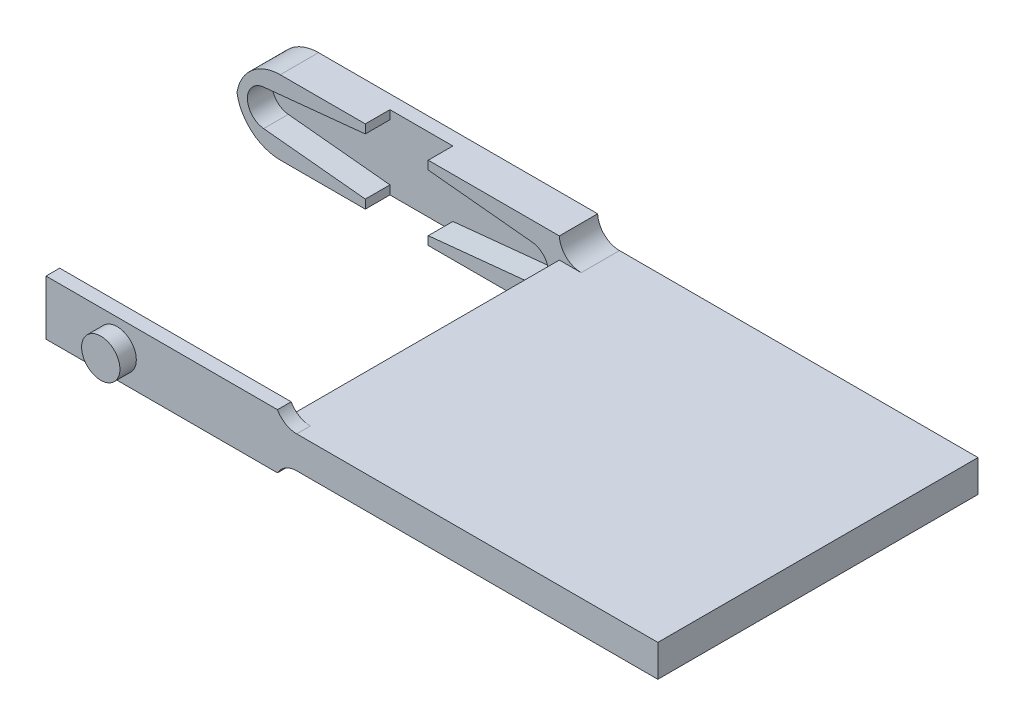
ISO-10303-21;
HEADER;
FILE_DESCRIPTION(('STEP AP214'),'2;1');
FILE_NAME('part.step','',(''),(''),'','','');
FILE_SCHEMA(('AUTOMOTIVE_DESIGN { 1 0 10303 214 1 1 1 1 }'));
ENDSEC;
DATA;
#1=APPLICATION_CONTEXT('core data for automotive mechanical design processes');
#2=APPLICATION_PROTOCOL_DEFINITION('international standard','automotive_design',2000,#1);
#3=PRODUCT_CONTEXT('',#1,'mechanical');
#4=PRODUCT('Part','Part','',(#3));
#5=PRODUCT_RELATED_PRODUCT_CATEGORY('part','',(#4));
#6=PRODUCT_DEFINITION_FORMATION('','',#4);
#7=PRODUCT_DEFINITION_CONTEXT('part definition',#1,'design');
#8=PRODUCT_DEFINITION('design','',#6,#7);
#9=PRODUCT_DEFINITION_SHAPE('','',#8);
#10=(LENGTH_UNIT() NAMED_UNIT(*) SI_UNIT(.MILLI.,.METRE.));
#11=(NAMED_UNIT(*) PLANE_ANGLE_UNIT() SI_UNIT($,.RADIAN.));
#12=(NAMED_UNIT(*) SI_UNIT($,.STERADIAN.) SOLID_ANGLE_UNIT());
#13=UNCERTAINTY_MEASURE_WITH_UNIT(LENGTH_MEASURE(1.E-05),#10,'distance_accuracy_value','');
#14=(GEOMETRIC_REPRESENTATION_CONTEXT(3) GLOBAL_UNCERTAINTY_ASSIGNED_CONTEXT((#13)) GLOBAL_UNIT_ASSIGNED_CONTEXT((#10,
#11,#12)) REPRESENTATION_CONTEXT('',''));
#15=CARTESIAN_POINT('',(0.,0.,0.));
#16=DIRECTION('',(0.,0.,1.));
#17=DIRECTION('',(1.,0.,0.));
#18=AXIS2_PLACEMENT_3D('',#15,#16,#17);
#19=CARTESIAN_POINT('',(0.,0.,29.25));
#20=DIRECTION('',(0.,0.,1.));
#21=DIRECTION('',(1.,0.,0.));
#22=AXIS2_PLACEMENT_3D('',#19,#20,#21);
#23=PLANE('',#22);
#24=DIRECTION('',(1.,0.,0.));
#25=VECTOR('',#24,1.);
#26=CARTESIAN_POINT('',(0.,4.83707186120483,29.25));
#27=LINE('',#26,#25);
#28=CARTESIAN_POINT('',(16.5034017605437,4.83707186120483,29.25));
#29=VERTEX_POINT('',#28);
#30=CARTESIAN_POINT('',(49.5,4.83707186120483,29.25));
#31=VERTEX_POINT('',#30);
#32=EDGE_CURVE('E509',#29,#31,#27,.T.);
#33=ORIENTED_EDGE('',*,*,#32,.F.);
#34=CARTESIAN_POINT('',(16.5034017605437,6.83707186120483,29.25));
#35=DIRECTION('',(0.,0.,1.));
#36=DIRECTION('',(1.,0.,0.));
#37=AXIS2_PLACEMENT_3D('',#34,#35,#36);
#38=CIRCLE('',#37,2.);
#39=CARTESIAN_POINT('',(14.75,5.87500000000001,29.25));
#40=VERTEX_POINT('',#39);
#41=EDGE_CURVE('E445',#29,#40,#38,.F.);
#42=ORIENTED_EDGE('',*,*,#41,.T.);
#43=DIRECTION('',(1.,0.,0.));
#44=VECTOR('',#43,1.);
#45=CARTESIAN_POINT('',(0.,5.87500000000001,29.25));
#46=LINE('',#45,#44);
#47=CARTESIAN_POINT('',(-6.4,5.875,29.25));
#48=VERTEX_POINT('',#47);
#49=EDGE_CURVE('E470',#48,#40,#46,.T.);
#50=ORIENTED_EDGE('',*,*,#49,.F.);
#51=DIRECTION('',(0.,-1.,0.));
#52=VECTOR('',#51,1.);
#53=CARTESIAN_POINT('',(-6.4,0.,29.25));
#54=LINE('',#53,#52);
#55=CARTESIAN_POINT('',(-6.4,0.875000000000003,29.25));
#56=VERTEX_POINT('',#55);
#57=EDGE_CURVE('E473',#48,#56,#54,.T.);
#58=ORIENTED_EDGE('',*,*,#57,.T.);
#59=DIRECTION('',(1.,0.,0.));
#60=VECTOR('',#59,1.);
#61=CARTESIAN_POINT('',(0.,0.875000000000003,29.25));
#62=LINE('',#61,#60);
#63=CARTESIAN_POINT('',(14.75,0.875000000000003,29.25));
#64=VERTEX_POINT('',#63);
#65=EDGE_CURVE('E488',#56,#64,#62,.T.);
#66=ORIENTED_EDGE('',*,*,#65,.T.);
#67=CARTESIAN_POINT('',(16.5034017605437,-0.0870718612048299,29.25));
#68=DIRECTION('',(0.,0.,1.));
#69=DIRECTION('',(1.,0.,0.));
#70=AXIS2_PLACEMENT_3D('',#67,#68,#69);
#71=CIRCLE('',#70,2.);
#72=CARTESIAN_POINT('',(16.5034017605437,1.91292813879517,29.25));
#73=VERTEX_POINT('',#72);
#74=EDGE_CURVE('E449',#64,#73,#71,.F.);
#75=ORIENTED_EDGE('',*,*,#74,.T.);
#76=DIRECTION('',(1.,0.,0.));
#77=VECTOR('',#76,1.);
#78=CARTESIAN_POINT('',(0.,1.91292813879517,29.25));
#79=LINE('',#78,#77);
#80=CARTESIAN_POINT('',(49.5,1.91292813879517,29.25));
#81=VERTEX_POINT('',#80);
#82=EDGE_CURVE('E511',#73,#81,#79,.T.);
#83=ORIENTED_EDGE('',*,*,#82,.T.);
#84=DIRECTION('',(0.,-1.,0.));
#85=VECTOR('',#84,1.);
#86=CARTESIAN_POINT('',(49.5,0.,29.25));
#87=LINE('',#86,#85);
#88=EDGE_CURVE('E513',#31,#81,#87,.T.);
#89=ORIENTED_EDGE('',*,*,#88,.F.);
#90=EDGE_LOOP('',(#33,#42,#50,#58,#66,#75,#83,#89));
#91=FACE_BOUND('',#90,.T.);
#92=CARTESIAN_POINT('',(0.102107464172212,3.37499999999922,29.25));
#93=DIRECTION('',(0.,0.,1.));
#94=DIRECTION('',(1.,0.,0.));
#95=AXIS2_PLACEMENT_3D('',#92,#93,#94);
#96=CIRCLE('',#95,1.75000000000137);
#97=CARTESIAN_POINT('',(1.85210746417358,3.37499999999922,29.25));
#98=VERTEX_POINT('',#97);
#99=EDGE_CURVE('E592',#98,#98,#96,.T.);
#100=ORIENTED_EDGE('',*,*,#99,.F.);
#101=EDGE_LOOP('',(#100));
#102=FACE_BOUND('',#101,.T.);
#103=ADVANCED_FACE('F139',(#91,#102),#23,.T.);
#104=CARTESIAN_POINT('',(0.,0.,3.5));
#105=DIRECTION('',(0.,0.,1.));
#106=DIRECTION('',(1.,0.,0.));
#107=AXIS2_PLACEMENT_3D('',#104,#105,#106);
#108=PLANE('',#107);
#109=DIRECTION('',(0.,-1.,0.));
#110=VECTOR('',#109,1.);
#111=CARTESIAN_POINT('',(-2.97710746417336,0.,3.5));
#112=LINE('',#111,#110);
#113=CARTESIAN_POINT('',(-2.97710746417336,0.799354218210052,3.5));
#114=VERTEX_POINT('',#113);
#115=CARTESIAN_POINT('',(-2.97710746417336,0.,3.5));
#116=VERTEX_POINT('',#115);
#117=EDGE_CURVE('E330',#114,#116,#112,.T.);
#118=ORIENTED_EDGE('',*,*,#117,.F.);
#119=DIRECTION('',(0.994982658758142,-0.10004753255617,0.));
#120=VECTOR('',#119,1.);
#121=CARTESIAN_POINT('',(0.0497727799724651,0.494995245614711,3.5));
#122=LINE('',#121,#120);
#123=CARTESIAN_POINT('',(-12.2650784287177,1.73327861304907,3.5));
#124=VERTEX_POINT('',#123);
#125=EDGE_CURVE('E370',#124,#114,#122,.T.);
#126=ORIENTED_EDGE('',*,*,#125,.F.);
#127=CARTESIAN_POINT('',(-12.1,3.375,3.5));
#128=DIRECTION('',(0.,0.,1.));
#129=DIRECTION('',(1.,0.,0.));
#130=AXIS2_PLACEMENT_3D('',#127,#128,#129);
#131=CIRCLE('',#130,1.65);
#132=CARTESIAN_POINT('',(-12.2650784287177,5.01672138695093,3.5));
#133=VERTEX_POINT('',#132);
#134=EDGE_CURVE('E372',#133,#124,#131,.T.);
#135=ORIENTED_EDGE('',*,*,#134,.F.);
#136=DIRECTION('',(0.994982658758143,0.100047532556171,0.));
#137=VECTOR('',#136,1.);
#138=CARTESIAN_POINT('',(-0.622159749655816,6.18744057018389,3.5));
#139=LINE('',#138,#137);
#140=CARTESIAN_POINT('',(-2.97710746417334,5.95064578178995,3.5));
#141=VERTEX_POINT('',#140);
#142=EDGE_CURVE('E375',#133,#141,#139,.T.);
#143=ORIENTED_EDGE('',*,*,#142,.T.);
#144=DIRECTION('',(0.,-1.,0.));
#145=VECTOR('',#144,1.);
#146=CARTESIAN_POINT('',(-2.97710746417327,6.74999999999991,3.5));
#147=LINE('',#146,#145);
#148=CARTESIAN_POINT('',(-2.97710746417327,6.74999999999991,3.5));
#149=VERTEX_POINT('',#148);
#150=EDGE_CURVE('E605',#149,#141,#147,.T.);
#151=ORIENTED_EDGE('',*,*,#150,.F.);
#152=DIRECTION('',(1.,0.,0.));
#153=VECTOR('',#152,1.);
#154=CARTESIAN_POINT('',(0.,6.75,3.5));
#155=LINE('',#154,#153);
#156=CARTESIAN_POINT('',(-10.75,6.75,3.5));
#157=VERTEX_POINT('',#156);
#158=EDGE_CURVE('E361',#157,#149,#155,.T.);
#159=ORIENTED_EDGE('',*,*,#158,.F.);
#160=CARTESIAN_POINT('',(-10.75,2.75,3.5));
#161=DIRECTION('',(0.,0.,1.));
#162=DIRECTION('',(1.,0.,0.));
#163=AXIS2_PLACEMENT_3D('',#160,#161,#162);
#164=CIRCLE('',#163,4.);
#165=CARTESIAN_POINT('',(-14.7008701573198,3.37499999999999,3.5));
#166=VERTEX_POINT('',#165);
#167=EDGE_CURVE('E148',#157,#166,#164,.T.);
#168=ORIENTED_EDGE('',*,*,#167,.T.);
#169=CARTESIAN_POINT('',(-10.75,4.,3.5));
#170=DIRECTION('',(0.,0.,1.));
#171=DIRECTION('',(1.,0.,0.));
#172=AXIS2_PLACEMENT_3D('',#169,#170,#171);
#173=CIRCLE('',#172,4.);
#174=CARTESIAN_POINT('',(-10.75,0.,3.5));
#175=VERTEX_POINT('',#174);
#176=EDGE_CURVE('E354',#166,#175,#173,.T.);
#177=ORIENTED_EDGE('',*,*,#176,.T.);
#178=DIRECTION('',(1.,0.,0.));
#179=VECTOR('',#178,1.);
#180=CARTESIAN_POINT('',(0.,0.,3.5));
#181=LINE('',#180,#179);
#182=EDGE_CURVE('E347',#175,#116,#181,.T.);
#183=ORIENTED_EDGE('',*,*,#182,.T.);
#184=EDGE_LOOP('',(#118,#126,#135,#143,#151,#159,#168,#177,#183));
#185=FACE_BOUND('',#184,.T.);
#186=ADVANCED_FACE('F352',(#185),#108,.T.);
#187=CARTESIAN_POINT('',(14.75,0.,29.25));
#188=DIRECTION('',(1.,0.,0.));
#189=DIRECTION('',(0.,1.,0.));
#190=AXIS2_PLACEMENT_3D('',#187,#188,#189);
#191=PLANE('',#190);
#192=DIRECTION('',(0.,-1.,0.));
#193=VECTOR('',#192,1.);
#194=CARTESIAN_POINT('',(14.75,0.,28.));
#195=LINE('',#194,#193);
#196=CARTESIAN_POINT('',(14.75,4.83707186120483,28.));
#197=VERTEX_POINT('',#196);
#198=CARTESIAN_POINT('',(14.75,1.91292813879517,28.));
#199=VERTEX_POINT('',#198);
#200=EDGE_CURVE('E484',#197,#199,#195,.T.);
#201=ORIENTED_EDGE('',*,*,#200,.F.);
#202=DIRECTION('',(0.,0.,-1.));
#203=VECTOR('',#202,1.);
#204=CARTESIAN_POINT('',(14.75,4.83707186120483,29.25));
#205=LINE('',#204,#203);
#206=CARTESIAN_POINT('',(14.75,4.83707186120483,3.5));
#207=VERTEX_POINT('',#206);
#208=EDGE_CURVE('E527',#197,#207,#205,.T.);
#209=ORIENTED_EDGE('',*,*,#208,.T.);
#210=DIRECTION('',(0.,-1.,0.));
#211=VECTOR('',#210,1.);
#212=CARTESIAN_POINT('',(14.75,0.,3.5));
#213=LINE('',#212,#211);
#214=CARTESIAN_POINT('',(14.75,1.91292813879517,3.5));
#215=VERTEX_POINT('',#214);
#216=EDGE_CURVE('E384',#207,#215,#213,.T.);
#217=ORIENTED_EDGE('',*,*,#216,.T.);
#218=DIRECTION('',(0.,0.,-1.));
#219=VECTOR('',#218,1.);
#220=CARTESIAN_POINT('',(14.75,1.91292813879517,29.25));
#221=LINE('',#220,#219);
#222=EDGE_CURVE('E524',#199,#215,#221,.T.);
#223=ORIENTED_EDGE('',*,*,#222,.F.);
#224=EDGE_LOOP('',(#201,#209,#217,#223));
#225=FACE_BOUND('',#224,.T.);
#226=ADVANCED_FACE('F647',(#225),#191,.F.);
#227=CARTESIAN_POINT('',(0.622159749655816,6.18744057018389,3.5));
#228=DIRECTION('',(-0.100047532556171,-0.994982658758142,0.));
#229=DIRECTION('',(0.994982658758142,-0.100047532556171,0.));
#230=AXIS2_PLACEMENT_3D('',#227,#228,#229);
#231=PLANE('',#230);
#232=DIRECTION('',(0.,0.,1.));
#233=VECTOR('',#232,1.);
#234=CARTESIAN_POINT('',(2.77289253582672,5.97118000870574,3.5));
#235=LINE('',#234,#233);
#236=CARTESIAN_POINT('',(2.77289253582672,5.97118000870574,1.24999999999997));
#237=VERTEX_POINT('',#236);
#238=CARTESIAN_POINT('',(2.77289253582672,5.97118000870574,3.5));
#239=VERTEX_POINT('',#238);
#240=EDGE_CURVE('E163',#237,#239,#235,.T.);
#241=ORIENTED_EDGE('',*,*,#240,.F.);
#242=DIRECTION('',(-0.994982658758143,0.100047532556171,0.));
#243=VECTOR('',#242,1.);
#244=CARTESIAN_POINT('',(0.622159749655816,6.18744057018389,1.25));
#245=LINE('',#244,#243);
#246=CARTESIAN_POINT('',(12.2650784287177,5.01672138695093,1.25));
#247=VERTEX_POINT('',#246);
#248=EDGE_CURVE('E533',#247,#237,#245,.T.);
#249=ORIENTED_EDGE('',*,*,#248,.F.);
#250=DIRECTION('',(0.,0.,-1.));
#251=VECTOR('',#250,1.);
#252=CARTESIAN_POINT('',(12.2650784287177,5.01672138695093,3.5));
#253=LINE('',#252,#251);
#254=CARTESIAN_POINT('',(12.2650784287177,5.01672138695093,3.5));
#255=VERTEX_POINT('',#254);
#256=EDGE_CURVE('E395',#255,#247,#253,.T.);
#257=ORIENTED_EDGE('',*,*,#256,.F.);
#258=DIRECTION('',(-0.994982658758143,0.100047532556171,0.));
#259=VECTOR('',#258,1.);
#260=CARTESIAN_POINT('',(0.622159749655816,6.18744057018389,3.5));
#261=LINE('',#260,#259);
#262=EDGE_CURVE('E355',#255,#239,#261,.T.);
#263=ORIENTED_EDGE('',*,*,#262,.T.);
#264=EDGE_LOOP('',(#241,#249,#257,#263));
#265=FACE_BOUND('',#264,.T.);
#266=ADVANCED_FACE('F662',(#265),#231,.T.);
#267=CARTESIAN_POINT('',(12.1,3.375,3.5));
#268=DIRECTION('',(0.,0.,-1.));
#269=DIRECTION('',(-1.,0.,0.));
#270=AXIS2_PLACEMENT_3D('',#267,#268,#269);
#271=CYLINDRICAL_SURFACE('',#270,1.64999999999999);
#272=ORIENTED_EDGE('',*,*,#256,.T.);
#273=CARTESIAN_POINT('',(12.1,3.375,1.25));
#274=DIRECTION('',(0.,0.,1.));
#275=DIRECTION('',(1.,0.,0.));
#276=AXIS2_PLACEMENT_3D('',#273,#274,#275);
#277=CIRCLE('',#276,1.64999999999999);
#278=CARTESIAN_POINT('',(12.2650784287177,1.73327861304907,1.25));
#279=VERTEX_POINT('',#278);
#280=EDGE_CURVE('E530',#247,#279,#277,.F.);
#281=ORIENTED_EDGE('',*,*,#280,.T.);
#282=DIRECTION('',(0.,0.,-1.));
#283=VECTOR('',#282,1.);
#284=CARTESIAN_POINT('',(12.2650784287177,1.73327861304907,3.5));
#285=LINE('',#284,#283);
#286=CARTESIAN_POINT('',(12.2650784287177,1.73327861304907,3.5));
#287=VERTEX_POINT('',#286);
#288=EDGE_CURVE('E392',#287,#279,#285,.T.);
#289=ORIENTED_EDGE('',*,*,#288,.F.);
#290=CARTESIAN_POINT('',(12.1,3.375,3.5));
#291=DIRECTION('',(0.,0.,1.));
#292=DIRECTION('',(1.,0.,0.));
#293=AXIS2_PLACEMENT_3D('',#290,#291,#292);
#294=CIRCLE('',#293,1.64999999999999);
#295=EDGE_CURVE('E359',#255,#287,#294,.F.);
#296=ORIENTED_EDGE('',*,*,#295,.F.);
#297=EDGE_LOOP('',(#272,#281,#289,#296));
#298=FACE_BOUND('',#297,.T.);
#299=ADVANCED_FACE('F638',(#298),#271,.F.);
#300=CARTESIAN_POINT('',(-0.0497727799724653,0.49499524561471,3.5));
#301=DIRECTION('',(0.100047532556171,-0.994982658758142,0.));
#302=DIRECTION('',(0.994982658758143,0.100047532556171,0.));
#303=AXIS2_PLACEMENT_3D('',#300,#301,#302);
#304=PLANE('',#303);
#305=DIRECTION('',(-0.994982658758142,-0.100047532556171,0.));
#306=VECTOR('',#305,1.);
#307=CARTESIAN_POINT('',(-0.0497727799724653,0.49499524561471,1.25));
#308=LINE('',#307,#306);
#309=CARTESIAN_POINT('',(2.77289253582672,0.778819991294262,1.24999999999997));
#310=VERTEX_POINT('',#309);
#311=EDGE_CURVE('E382',#279,#310,#308,.T.);
#312=ORIENTED_EDGE('',*,*,#311,.T.);
#313=DIRECTION('',(0.,0.,1.));
#314=VECTOR('',#313,1.);
#315=CARTESIAN_POINT('',(2.77289253582672,0.778819991294262,3.5));
#316=LINE('',#315,#314);
#317=CARTESIAN_POINT('',(2.77289253582672,0.778819991294262,3.5));
#318=VERTEX_POINT('',#317);
#319=EDGE_CURVE('E599',#310,#318,#316,.T.);
#320=ORIENTED_EDGE('',*,*,#319,.T.);
#321=DIRECTION('',(-0.994982658758142,-0.100047532556171,0.));
#322=VECTOR('',#321,1.);
#323=CARTESIAN_POINT('',(-0.0497727799724653,0.49499524561471,3.5));
#324=LINE('',#323,#322);
#325=EDGE_CURVE('E367',#287,#318,#324,.T.);
#326=ORIENTED_EDGE('',*,*,#325,.F.);
#327=ORIENTED_EDGE('',*,*,#288,.T.);
#328=EDGE_LOOP('',(#312,#320,#326,#327));
#329=FACE_BOUND('',#328,.T.);
#330=ADVANCED_FACE('F631',(#329),#304,.F.);
#331=CARTESIAN_POINT('',(0.0497727799724651,0.494995245614711,3.5));
#332=DIRECTION('',(0.10004753255617,0.994982658758143,0.));
#333=DIRECTION('',(-0.994982658758143,0.10004753255617,0.));
#334=AXIS2_PLACEMENT_3D('',#331,#332,#333);
#335=PLANE('',#334);
#336=DIRECTION('',(0.,0.,1.));
#337=VECTOR('',#336,1.);
#338=CARTESIAN_POINT('',(-2.97710746417336,0.799354218210052,3.5));
#339=LINE('',#338,#337);
#340=CARTESIAN_POINT('',(-2.97710746417336,0.799354218210052,1.24999999999997));
#341=VERTEX_POINT('',#340);
#342=EDGE_CURVE('E336',#341,#114,#339,.T.);
#343=ORIENTED_EDGE('',*,*,#342,.F.);
#344=DIRECTION('',(0.994982658758142,-0.10004753255617,0.));
#345=VECTOR('',#344,1.);
#346=CARTESIAN_POINT('',(0.0497727799724651,0.494995245614711,1.25));
#347=LINE('',#346,#345);
#348=CARTESIAN_POINT('',(-12.2650784287177,1.73327861304907,1.25));
#349=VERTEX_POINT('',#348);
#350=EDGE_CURVE('E540',#349,#341,#347,.T.);
#351=ORIENTED_EDGE('',*,*,#350,.F.);
#352=DIRECTION('',(0.,0.,-1.));
#353=VECTOR('',#352,1.);
#354=CARTESIAN_POINT('',(-12.2650784287177,1.73327861304907,3.5));
#355=LINE('',#354,#353);
#356=EDGE_CURVE('E388',#124,#349,#355,.T.);
#357=ORIENTED_EDGE('',*,*,#356,.F.);
#358=ORIENTED_EDGE('',*,*,#125,.T.);
#359=EDGE_LOOP('',(#343,#351,#357,#358));
#360=FACE_BOUND('',#359,.T.);
#361=ADVANCED_FACE('F629',(#360),#335,.T.);
#362=CARTESIAN_POINT('',(-12.1,3.375,3.5));
#363=DIRECTION('',(0.,0.,-1.));
#364=DIRECTION('',(-1.,0.,0.));
#365=AXIS2_PLACEMENT_3D('',#362,#363,#364);
#366=CYLINDRICAL_SURFACE('',#365,1.65);
#367=CARTESIAN_POINT('',(-12.1,3.375,1.25));
#368=DIRECTION('',(0.,0.,1.));
#369=DIRECTION('',(1.,0.,0.));
#370=AXIS2_PLACEMENT_3D('',#367,#368,#369);
#371=CIRCLE('',#370,1.65);
#372=CARTESIAN_POINT('',(-12.2650784287177,5.01672138695093,1.25));
#373=VERTEX_POINT('',#372);
#374=EDGE_CURVE('E538',#373,#349,#371,.T.);
#375=ORIENTED_EDGE('',*,*,#374,.F.);
#376=DIRECTION('',(0.,0.,-1.));
#377=VECTOR('',#376,1.);
#378=CARTESIAN_POINT('',(-12.2650784287177,5.01672138695093,3.5));
#379=LINE('',#378,#377);
#380=EDGE_CURVE('E385',#133,#373,#379,.T.);
#381=ORIENTED_EDGE('',*,*,#380,.F.);
#382=ORIENTED_EDGE('',*,*,#134,.T.);
#383=ORIENTED_EDGE('',*,*,#356,.T.);
#384=EDGE_LOOP('',(#375,#381,#382,#383));
#385=FACE_BOUND('',#384,.T.);
#386=ADVANCED_FACE('F624',(#385),#366,.F.);
#387=CARTESIAN_POINT('',(0.,6.75,3.5));
#388=DIRECTION('',(0.,1.,0.));
#389=DIRECTION('',(0.,0.,1.));
#390=AXIS2_PLACEMENT_3D('',#387,#388,#389);
#391=PLANE('',#390);
#392=DIRECTION('',(0.,0.,1.));
#393=VECTOR('',#392,1.);
#394=CARTESIAN_POINT('',(-2.97710746417327,6.74999999999991,-4.60902082262912));
#395=LINE('',#394,#393);
#396=CARTESIAN_POINT('',(-2.97710746417327,6.74999999999991,1.24999999999997));
#397=VERTEX_POINT('',#396);
#398=EDGE_CURVE('E480',#397,#149,#395,.T.);
#399=ORIENTED_EDGE('',*,*,#398,.F.);
#400=DIRECTION('',(-1.,0.,0.));
#401=VECTOR('',#400,1.);
#402=CARTESIAN_POINT('',(-2.97710746417327,6.74999999999991,1.24999999999997));
#403=LINE('',#402,#401);
#404=CARTESIAN_POINT('',(2.77289253582672,6.74999999999991,1.24999999999997));
#405=VERTEX_POINT('',#404);
#406=EDGE_CURVE('E613',#405,#397,#403,.T.);
#407=ORIENTED_EDGE('',*,*,#406,.F.);
#408=DIRECTION('',(0.,0.,1.));
#409=VECTOR('',#408,1.);
#410=CARTESIAN_POINT('',(2.77289253582672,6.74999999999991,-4.60902082262912));
#411=LINE('',#410,#409);
#412=CARTESIAN_POINT('',(2.77289253582672,6.74999999999991,3.5));
#413=VERTEX_POINT('',#412);
#414=EDGE_CURVE('E616',#405,#413,#411,.T.);
#415=ORIENTED_EDGE('',*,*,#414,.T.);
#416=CARTESIAN_POINT('',(14.75,6.75,3.5));
#417=VERTEX_POINT('',#416);
#418=EDGE_CURVE('E545',#413,#417,#155,.T.);
#419=ORIENTED_EDGE('',*,*,#418,.T.);
#420=DIRECTION('',(0.,0.,-1.));
#421=VECTOR('',#420,1.);
#422=CARTESIAN_POINT('',(14.75,6.75,3.5));
#423=LINE('',#422,#421);
#424=CARTESIAN_POINT('',(14.75,6.75,0.));
#425=VERTEX_POINT('',#424);
#426=EDGE_CURVE('E389',#417,#425,#423,.T.);
#427=ORIENTED_EDGE('',*,*,#426,.T.);
#428=DIRECTION('',(1.,0.,0.));
#429=VECTOR('',#428,1.);
#430=CARTESIAN_POINT('',(0.,6.75,0.));
#431=LINE('',#430,#429);
#432=CARTESIAN_POINT('',(-10.75,6.75,0.));
#433=VERTEX_POINT('',#432);
#434=EDGE_CURVE('E379',#433,#425,#431,.T.);
#435=ORIENTED_EDGE('',*,*,#434,.F.);
#436=DIRECTION('',(0.,0.,-1.));
#437=VECTOR('',#436,1.);
#438=CARTESIAN_POINT('',(-10.75,6.75,3.5));
#439=LINE('',#438,#437);
#440=EDGE_CURVE('E455',#433,#157,#439,.F.);
#441=ORIENTED_EDGE('',*,*,#440,.T.);
#442=ORIENTED_EDGE('',*,*,#158,.T.);
#443=EDGE_LOOP('',(#399,#407,#415,#419,#427,#435,#441,#442));
#444=FACE_BOUND('',#443,.T.);
#445=ADVANCED_FACE('F553',(#444),#391,.T.);
#446=CARTESIAN_POINT('',(0.,0.,3.5));
#447=DIRECTION('',(0.,1.,0.));
#448=DIRECTION('',(0.,0.,1.));
#449=AXIS2_PLACEMENT_3D('',#446,#447,#448);
#450=PLANE('',#449);
#451=DIRECTION('',(1.,0.,0.));
#452=VECTOR('',#451,1.);
#453=CARTESIAN_POINT('',(-2.97710746417337,0.,1.24999999999997));
#454=LINE('',#453,#452);
#455=CARTESIAN_POINT('',(-2.97710746417336,0.,1.24999999999997));
#456=VERTEX_POINT('',#455);
#457=CARTESIAN_POINT('',(2.77289253582672,0.,1.24999999999997));
#458=VERTEX_POINT('',#457);
#459=EDGE_CURVE('E350',#456,#458,#454,.T.);
#460=ORIENTED_EDGE('',*,*,#459,.F.);
#461=DIRECTION('',(0.,0.,1.));
#462=VECTOR('',#461,1.);
#463=CARTESIAN_POINT('',(-2.97710746417336,0.,-4.60902082262912));
#464=LINE('',#463,#462);
#465=EDGE_CURVE('E333',#456,#116,#464,.T.);
#466=ORIENTED_EDGE('',*,*,#465,.T.);
#467=ORIENTED_EDGE('',*,*,#182,.F.);
#468=DIRECTION('',(0.,0.,-1.));
#469=VECTOR('',#468,1.);
#470=CARTESIAN_POINT('',(-10.75,0.,0.));
#471=LINE('',#470,#469);
#472=CARTESIAN_POINT('',(-10.75,0.,0.));
#473=VERTEX_POINT('',#472);
#474=EDGE_CURVE('E12',#175,#473,#471,.T.);
#475=ORIENTED_EDGE('',*,*,#474,.T.);
#476=DIRECTION('',(1.,0.,0.));
#477=VECTOR('',#476,1.);
#478=CARTESIAN_POINT('',(0.,0.,0.));
#479=LINE('',#478,#477);
#480=CARTESIAN_POINT('',(14.75,0.,0.));
#481=VERTEX_POINT('',#480);
#482=EDGE_CURVE('E381',#473,#481,#479,.T.);
#483=ORIENTED_EDGE('',*,*,#482,.T.);
#484=DIRECTION('',(0.,0.,-1.));
#485=VECTOR('',#484,1.);
#486=CARTESIAN_POINT('',(14.75,0.,3.5));
#487=LINE('',#486,#485);
#488=CARTESIAN_POINT('',(14.75,0.,3.5));
#489=VERTEX_POINT('',#488);
#490=EDGE_CURVE('E378',#489,#481,#487,.T.);
#491=ORIENTED_EDGE('',*,*,#490,.F.);
#492=CARTESIAN_POINT('',(2.77289253582672,0.,3.5));
#493=VERTEX_POINT('',#492);
#494=EDGE_CURVE('E356',#493,#489,#181,.T.);
#495=ORIENTED_EDGE('',*,*,#494,.F.);
#496=DIRECTION('',(0.,0.,1.));
#497=VECTOR('',#496,1.);
#498=CARTESIAN_POINT('',(2.77289253582672,0.,-4.60902082262912));
#499=LINE('',#498,#497);
#500=EDGE_CURVE('E155',#458,#493,#499,.T.);
#501=ORIENTED_EDGE('',*,*,#500,.F.);
#502=EDGE_LOOP('',(#460,#466,#467,#475,#483,#491,#495,#501));
#503=FACE_BOUND('',#502,.T.);
#504=ADVANCED_FACE('F346',(#503),#450,.F.);
#505=CARTESIAN_POINT('',(-0.622159749655816,6.18744057018389,3.5));
#506=DIRECTION('',(-0.100047532556171,0.994982658758142,0.));
#507=DIRECTION('',(-0.994982658758142,-0.100047532556171,0.));
#508=AXIS2_PLACEMENT_3D('',#505,#506,#507);
#509=PLANE('',#508);
#510=DIRECTION('',(0.994982658758143,0.100047532556171,0.));
#511=VECTOR('',#510,1.);
#512=CARTESIAN_POINT('',(-0.622159749655816,6.18744057018389,1.25));
#513=LINE('',#512,#511);
#514=CARTESIAN_POINT('',(-2.97710746417334,5.95064578178995,1.24999999999997));
#515=VERTEX_POINT('',#514);
#516=EDGE_CURVE('E536',#373,#515,#513,.T.);
#517=ORIENTED_EDGE('',*,*,#516,.T.);
#518=DIRECTION('',(0.,0.,1.));
#519=VECTOR('',#518,1.);
#520=CARTESIAN_POINT('',(-2.97710746417334,5.95064578178995,3.5));
#521=LINE('',#520,#519);
#522=EDGE_CURVE('E471',#515,#141,#521,.T.);
#523=ORIENTED_EDGE('',*,*,#522,.T.);
#524=ORIENTED_EDGE('',*,*,#142,.F.);
#525=ORIENTED_EDGE('',*,*,#380,.T.);
#526=EDGE_LOOP('',(#517,#523,#524,#525));
#527=FACE_BOUND('',#526,.T.);
#528=ADVANCED_FACE('F621',(#527),#509,.F.);
#529=DIRECTION('',(0.,1.,0.));
#530=VECTOR('',#529,1.);
#531=CARTESIAN_POINT('',(2.77289253582672,0.,3.5));
#532=LINE('',#531,#530);
#533=EDGE_CURVE('E342',#493,#318,#532,.T.);
#534=ORIENTED_EDGE('',*,*,#533,.F.);
#535=ORIENTED_EDGE('',*,*,#494,.T.);
#536=CARTESIAN_POINT('',(16.7481037237807,-0.0870718612048299,3.5));
#537=DIRECTION('',(0.,0.,1.));
#538=DIRECTION('',(1.,0.,0.));
#539=AXIS2_PLACEMENT_3D('',#536,#537,#538);
#540=CIRCLE('',#539,2.);
#541=CARTESIAN_POINT('',(16.7481037237807,1.91292813879517,3.5));
#542=VERTEX_POINT('',#541);
#543=EDGE_CURVE('E441',#489,#542,#540,.F.);
#544=ORIENTED_EDGE('',*,*,#543,.T.);
#545=DIRECTION('',(1.,0.,0.));
#546=VECTOR('',#545,1.);
#547=CARTESIAN_POINT('',(0.,1.91292813879517,3.5));
#548=LINE('',#547,#546);
#549=EDGE_CURVE('E427',#215,#542,#548,.T.);
#550=ORIENTED_EDGE('',*,*,#549,.F.);
#551=ORIENTED_EDGE('',*,*,#216,.F.);
#552=DIRECTION('',(-1.,0.,0.));
#553=VECTOR('',#552,1.);
#554=CARTESIAN_POINT('',(0.,4.83707186120483,3.5));
#555=LINE('',#554,#553);
#556=CARTESIAN_POINT('',(16.7481037237807,4.83707186120483,3.5));
#557=VERTEX_POINT('',#556);
#558=EDGE_CURVE('E415',#557,#207,#555,.T.);
#559=ORIENTED_EDGE('',*,*,#558,.F.);
#560=CARTESIAN_POINT('',(16.7481037237807,6.83707186120483,3.5));
#561=DIRECTION('',(0.,0.,1.));
#562=DIRECTION('',(1.,0.,0.));
#563=AXIS2_PLACEMENT_3D('',#560,#561,#562);
#564=CIRCLE('',#563,2.);
#565=EDGE_CURVE('E435',#557,#417,#564,.F.);
#566=ORIENTED_EDGE('',*,*,#565,.T.);
#567=ORIENTED_EDGE('',*,*,#418,.F.);
#568=DIRECTION('',(0.,1.,0.));
#569=VECTOR('',#568,1.);
#570=CARTESIAN_POINT('',(2.77289253582672,6.74999999999991,3.5));
#571=LINE('',#570,#569);
#572=EDGE_CURVE('E606',#239,#413,#571,.T.);
#573=ORIENTED_EDGE('',*,*,#572,.F.);
#574=ORIENTED_EDGE('',*,*,#262,.F.);
#575=ORIENTED_EDGE('',*,*,#295,.T.);
#576=ORIENTED_EDGE('',*,*,#325,.T.);
#577=EDGE_LOOP('',(#534,#535,#544,#550,#551,#559,#566,#567,#573,#574,#575,#576));
#578=FACE_BOUND('',#577,.T.);
#579=ADVANCED_FACE('F587',(#578),#108,.T.);
#580=CARTESIAN_POINT('',(0.,0.,0.));
#581=DIRECTION('',(0.,0.,1.));
#582=DIRECTION('',(1.,0.,0.));
#583=AXIS2_PLACEMENT_3D('',#580,#581,#582);
#584=PLANE('',#583);
#585=CARTESIAN_POINT('',(-10.75,4.,0.));
#586=DIRECTION('',(0.,0.,1.));
#587=DIRECTION('',(1.,0.,0.));
#588=AXIS2_PLACEMENT_3D('',#585,#586,#587);
#589=CIRCLE('',#588,4.);
#590=CARTESIAN_POINT('',(-14.7008701573198,3.37499999999999,0.));
#591=VERTEX_POINT('',#590);
#592=EDGE_CURVE('E451',#473,#591,#589,.F.);
#593=ORIENTED_EDGE('',*,*,#592,.T.);
#594=CARTESIAN_POINT('',(-10.75,2.75,0.));
#595=DIRECTION('',(0.,0.,1.));
#596=DIRECTION('',(1.,0.,0.));
#597=AXIS2_PLACEMENT_3D('',#594,#595,#596);
#598=CIRCLE('',#597,4.);
#599=EDGE_CURVE('E453',#591,#433,#598,.F.);
#600=ORIENTED_EDGE('',*,*,#599,.T.);
#601=ORIENTED_EDGE('',*,*,#434,.T.);
#602=CARTESIAN_POINT('',(16.7481037237807,6.83707186120483,0.));
#603=DIRECTION('',(0.,0.,1.));
#604=DIRECTION('',(1.,0.,0.));
#605=AXIS2_PLACEMENT_3D('',#602,#603,#604);
#606=CIRCLE('',#605,2.);
#607=CARTESIAN_POINT('',(16.7481037237807,4.83707186120483,0.));
#608=VERTEX_POINT('',#607);
#609=EDGE_CURVE('E433',#425,#608,#606,.T.);
#610=ORIENTED_EDGE('',*,*,#609,.T.);
#611=DIRECTION('',(1.,0.,0.));
#612=VECTOR('',#611,1.);
#613=CARTESIAN_POINT('',(0.,4.83707186120483,0.));
#614=LINE('',#613,#612);
#615=CARTESIAN_POINT('',(49.5,4.83707186120483,0.));
#616=VERTEX_POINT('',#615);
#617=EDGE_CURVE('E407',#608,#616,#614,.T.);
#618=ORIENTED_EDGE('',*,*,#617,.T.);
#619=DIRECTION('',(0.,-1.,0.));
#620=VECTOR('',#619,1.);
#621=CARTESIAN_POINT('',(49.5,0.,0.));
#622=LINE('',#621,#620);
#623=CARTESIAN_POINT('',(49.5,1.91292813879517,0.));
#624=VERTEX_POINT('',#623);
#625=EDGE_CURVE('E422',#616,#624,#622,.T.);
#626=ORIENTED_EDGE('',*,*,#625,.T.);
#627=DIRECTION('',(1.,0.,0.));
#628=VECTOR('',#627,1.);
#629=CARTESIAN_POINT('',(0.,1.91292813879517,0.));
#630=LINE('',#629,#628);
#631=CARTESIAN_POINT('',(16.7481037237807,1.91292813879517,0.));
#632=VERTEX_POINT('',#631);
#633=EDGE_CURVE('E409',#632,#624,#630,.T.);
#634=ORIENTED_EDGE('',*,*,#633,.F.);
#635=CARTESIAN_POINT('',(16.7481037237807,-0.0870718612048299,0.));
#636=DIRECTION('',(0.,0.,1.));
#637=DIRECTION('',(1.,0.,0.));
#638=AXIS2_PLACEMENT_3D('',#635,#636,#637);
#639=CIRCLE('',#638,2.);
#640=EDGE_CURVE('E438',#632,#481,#639,.T.);
#641=ORIENTED_EDGE('',*,*,#640,.T.);
#642=ORIENTED_EDGE('',*,*,#482,.F.);
#643=EDGE_LOOP('',(#593,#600,#601,#610,#618,#626,#634,#641,#642));
#644=FACE_BOUND('',#643,.T.);
#645=ADVANCED_FACE('F559',(#644),#584,.F.);
#646=CARTESIAN_POINT('',(0.,0.,1.25));
#647=DIRECTION('',(0.,0.,1.));
#648=DIRECTION('',(1.,0.,0.));
#649=AXIS2_PLACEMENT_3D('',#646,#647,#648);
#650=PLANE('',#649);
#651=ORIENTED_EDGE('',*,*,#350,.T.);
#652=DIRECTION('',(0.,-1.,0.));
#653=VECTOR('',#652,1.);
#654=CARTESIAN_POINT('',(-2.97710746417336,0.,1.24999999999997));
#655=LINE('',#654,#653);
#656=EDGE_CURVE('E341',#341,#456,#655,.T.);
#657=ORIENTED_EDGE('',*,*,#656,.T.);
#658=ORIENTED_EDGE('',*,*,#459,.T.);
#659=DIRECTION('',(0.,1.,0.));
#660=VECTOR('',#659,1.);
#661=CARTESIAN_POINT('',(2.77289253582672,0.,1.24999999999997));
#662=LINE('',#661,#660);
#663=EDGE_CURVE('E596',#458,#310,#662,.T.);
#664=ORIENTED_EDGE('',*,*,#663,.T.);
#665=ORIENTED_EDGE('',*,*,#311,.F.);
#666=ORIENTED_EDGE('',*,*,#280,.F.);
#667=ORIENTED_EDGE('',*,*,#248,.T.);
#668=DIRECTION('',(0.,1.,0.));
#669=VECTOR('',#668,1.);
#670=CARTESIAN_POINT('',(2.77289253582672,6.74999999999991,1.24999999999997));
#671=LINE('',#670,#669);
#672=EDGE_CURVE('E612',#237,#405,#671,.T.);
#673=ORIENTED_EDGE('',*,*,#672,.T.);
#674=ORIENTED_EDGE('',*,*,#406,.T.);
#675=DIRECTION('',(0.,-1.,0.));
#676=VECTOR('',#675,1.);
#677=CARTESIAN_POINT('',(-2.97710746417327,6.74999999999991,1.24999999999997));
#678=LINE('',#677,#676);
#679=EDGE_CURVE('E608',#397,#515,#678,.T.);
#680=ORIENTED_EDGE('',*,*,#679,.T.);
#681=ORIENTED_EDGE('',*,*,#516,.F.);
#682=ORIENTED_EDGE('',*,*,#374,.T.);
#683=EDGE_LOOP('',(#651,#657,#658,#664,#665,#666,#667,#673,#674,#680,#681,#682));
#684=FACE_BOUND('',#683,.T.);
#685=ADVANCED_FACE('F627',(#684),#650,.T.);
#686=CARTESIAN_POINT('',(0.,4.83707186120483,29.25));
#687=DIRECTION('',(0.,1.,0.));
#688=DIRECTION('',(0.,0.,1.));
#689=AXIS2_PLACEMENT_3D('',#686,#687,#688);
#690=PLANE('',#689);
#691=ORIENTED_EDGE('',*,*,#617,.F.);
#692=DIRECTION('',(0.,0.,-1.));
#693=VECTOR('',#692,1.);
#694=CARTESIAN_POINT('',(16.7481037237807,4.83707186120483,3.5));
#695=LINE('',#694,#693);
#696=EDGE_CURVE('E417',#608,#557,#695,.F.);
#697=ORIENTED_EDGE('',*,*,#696,.T.);
#698=ORIENTED_EDGE('',*,*,#558,.T.);
#699=ORIENTED_EDGE('',*,*,#208,.F.);
#700=DIRECTION('',(1.,0.,0.));
#701=VECTOR('',#700,1.);
#702=CARTESIAN_POINT('',(0.,4.83707186120483,28.));
#703=LINE('',#702,#701);
#704=CARTESIAN_POINT('',(16.5034017605437,4.83707186120483,28.));
#705=VERTEX_POINT('',#704);
#706=EDGE_CURVE('E412',#197,#705,#703,.T.);
#707=ORIENTED_EDGE('',*,*,#706,.T.);
#708=DIRECTION('',(0.,0.,-1.));
#709=VECTOR('',#708,1.);
#710=CARTESIAN_POINT('',(16.5034017605437,4.83707186120483,29.25));
#711=LINE('',#710,#709);
#712=EDGE_CURVE('E398',#705,#29,#711,.F.);
#713=ORIENTED_EDGE('',*,*,#712,.T.);
#714=ORIENTED_EDGE('',*,*,#32,.T.);
#715=DIRECTION('',(0.,0.,-1.));
#716=VECTOR('',#715,1.);
#717=CARTESIAN_POINT('',(49.5,4.83707186120483,29.25));
#718=LINE('',#717,#716);
#719=EDGE_CURVE('E516',#31,#616,#718,.T.);
#720=ORIENTED_EDGE('',*,*,#719,.T.);
#721=EDGE_LOOP('',(#691,#697,#698,#699,#707,#713,#714,#720));
#722=FACE_BOUND('',#721,.T.);
#723=ADVANCED_FACE('F566',(#722),#690,.T.);
#724=CARTESIAN_POINT('',(0.,1.91292813879517,29.25));
#725=DIRECTION('',(0.,1.,0.));
#726=DIRECTION('',(0.,0.,1.));
#727=AXIS2_PLACEMENT_3D('',#724,#725,#726);
#728=PLANE('',#727);
#729=ORIENTED_EDGE('',*,*,#549,.T.);
#730=DIRECTION('',(0.,0.,1.));
#731=VECTOR('',#730,1.);
#732=CARTESIAN_POINT('',(16.7481037237807,1.91292813879517,29.25));
#733=LINE('',#732,#731);
#734=EDGE_CURVE('E430',#542,#632,#733,.F.);
#735=ORIENTED_EDGE('',*,*,#734,.T.);
#736=ORIENTED_EDGE('',*,*,#633,.T.);
#737=DIRECTION('',(0.,0.,-1.));
#738=VECTOR('',#737,1.);
#739=CARTESIAN_POINT('',(49.5,1.91292813879517,29.25));
#740=LINE('',#739,#738);
#741=EDGE_CURVE('E521',#81,#624,#740,.T.);
#742=ORIENTED_EDGE('',*,*,#741,.F.);
#743=ORIENTED_EDGE('',*,*,#82,.F.);
#744=DIRECTION('',(0.,0.,1.));
#745=VECTOR('',#744,1.);
#746=CARTESIAN_POINT('',(16.5034017605437,1.91292813879517,29.25));
#747=LINE('',#746,#745);
#748=CARTESIAN_POINT('',(16.5034017605437,1.91292813879517,28.));
#749=VERTEX_POINT('',#748);
#750=EDGE_CURVE('E424',#73,#749,#747,.F.);
#751=ORIENTED_EDGE('',*,*,#750,.T.);
#752=DIRECTION('',(-1.,0.,0.));
#753=VECTOR('',#752,1.);
#754=CARTESIAN_POINT('',(0.,1.91292813879517,28.));
#755=LINE('',#754,#753);
#756=EDGE_CURVE('E420',#749,#199,#755,.T.);
#757=ORIENTED_EDGE('',*,*,#756,.T.);
#758=ORIENTED_EDGE('',*,*,#222,.T.);
#759=EDGE_LOOP('',(#729,#735,#736,#742,#743,#751,#757,#758));
#760=FACE_BOUND('',#759,.T.);
#761=ADVANCED_FACE('F577',(#760),#728,.F.);
#762=CARTESIAN_POINT('',(49.5,0.,29.25));
#763=DIRECTION('',(1.,0.,0.));
#764=DIRECTION('',(0.,0.,-1.));
#765=AXIS2_PLACEMENT_3D('',#762,#763,#764);
#766=PLANE('',#765);
#767=ORIENTED_EDGE('',*,*,#625,.F.);
#768=ORIENTED_EDGE('',*,*,#719,.F.);
#769=ORIENTED_EDGE('',*,*,#88,.T.);
#770=ORIENTED_EDGE('',*,*,#741,.T.);
#771=EDGE_LOOP('',(#767,#768,#769,#770));
#772=FACE_BOUND('',#771,.T.);
#773=ADVANCED_FACE('F572',(#772),#766,.T.);
#774=CARTESIAN_POINT('',(-6.4,0.,28.));
#775=DIRECTION('',(-1.,0.,0.));
#776=DIRECTION('',(0.,0.,1.));
#777=AXIS2_PLACEMENT_3D('',#774,#775,#776);
#778=PLANE('',#777);
#779=ORIENTED_EDGE('',*,*,#57,.F.);
#780=DIRECTION('',(0.,0.,1.));
#781=VECTOR('',#780,1.);
#782=CARTESIAN_POINT('',(-6.4,5.875,28.));
#783=LINE('',#782,#781);
#784=CARTESIAN_POINT('',(-6.4,5.875,28.));
#785=VERTEX_POINT('',#784);
#786=EDGE_CURVE('E505',#785,#48,#783,.T.);
#787=ORIENTED_EDGE('',*,*,#786,.F.);
#788=DIRECTION('',(0.,-1.,0.));
#789=VECTOR('',#788,1.);
#790=CARTESIAN_POINT('',(-6.4,0.,28.));
#791=LINE('',#790,#789);
#792=CARTESIAN_POINT('',(-6.4,0.875000000000003,28.));
#793=VERTEX_POINT('',#792);
#794=EDGE_CURVE('E491',#785,#793,#791,.T.);
#795=ORIENTED_EDGE('',*,*,#794,.T.);
#796=DIRECTION('',(0.,0.,1.));
#797=VECTOR('',#796,1.);
#798=CARTESIAN_POINT('',(-6.4,0.875000000000003,28.));
#799=LINE('',#798,#797);
#800=EDGE_CURVE('E503',#793,#56,#799,.T.);
#801=ORIENTED_EDGE('',*,*,#800,.T.);
#802=EDGE_LOOP('',(#779,#787,#795,#801));
#803=FACE_BOUND('',#802,.T.);
#804=ADVANCED_FACE('F657',(#803),#778,.T.);
#805=CARTESIAN_POINT('',(0.,0.875000000000003,28.));
#806=DIRECTION('',(0.,-1.,0.));
#807=DIRECTION('',(1.,0.,0.));
#808=AXIS2_PLACEMENT_3D('',#805,#806,#807);
#809=PLANE('',#808);
#810=ORIENTED_EDGE('',*,*,#65,.F.);
#811=ORIENTED_EDGE('',*,*,#800,.F.);
#812=DIRECTION('',(1.,0.,0.));
#813=VECTOR('',#812,1.);
#814=CARTESIAN_POINT('',(0.,0.875000000000003,28.));
#815=LINE('',#814,#813);
#816=CARTESIAN_POINT('',(14.75,0.875000000000003,28.));
#817=VERTEX_POINT('',#816);
#818=EDGE_CURVE('E494',#793,#817,#815,.T.);
#819=ORIENTED_EDGE('',*,*,#818,.T.);
#820=DIRECTION('',(0.,0.,1.));
#821=VECTOR('',#820,1.);
#822=CARTESIAN_POINT('',(14.75,0.875000000000003,28.));
#823=LINE('',#822,#821);
#824=EDGE_CURVE('E410',#817,#64,#823,.T.);
#825=ORIENTED_EDGE('',*,*,#824,.T.);
#826=EDGE_LOOP('',(#810,#811,#819,#825));
#827=FACE_BOUND('',#826,.T.);
#828=ADVANCED_FACE('F733',(#827),#809,.T.);
#829=CARTESIAN_POINT('',(0.,5.87500000000001,28.));
#830=DIRECTION('',(0.,-1.,0.));
#831=DIRECTION('',(1.,0.,0.));
#832=AXIS2_PLACEMENT_3D('',#829,#830,#831);
#833=PLANE('',#832);
#834=ORIENTED_EDGE('',*,*,#49,.T.);
#835=DIRECTION('',(0.,0.,1.));
#836=VECTOR('',#835,1.);
#837=CARTESIAN_POINT('',(14.75,5.87500000000001,28.));
#838=LINE('',#837,#836);
#839=CARTESIAN_POINT('',(14.75,5.87500000000001,28.));
#840=VERTEX_POINT('',#839);
#841=EDGE_CURVE('E496',#840,#40,#838,.T.);
#842=ORIENTED_EDGE('',*,*,#841,.F.);
#843=DIRECTION('',(1.,0.,0.));
#844=VECTOR('',#843,1.);
#845=CARTESIAN_POINT('',(0.,5.87500000000001,28.));
#846=LINE('',#845,#844);
#847=EDGE_CURVE('E487',#785,#840,#846,.T.);
#848=ORIENTED_EDGE('',*,*,#847,.F.);
#849=ORIENTED_EDGE('',*,*,#786,.T.);
#850=EDGE_LOOP('',(#834,#842,#848,#849));
#851=FACE_BOUND('',#850,.T.);
#852=ADVANCED_FACE('F653',(#851),#833,.F.);
#853=CARTESIAN_POINT('',(0.,0.,28.));
#854=DIRECTION('',(0.,0.,1.));
#855=DIRECTION('',(1.,0.,0.));
#856=AXIS2_PLACEMENT_3D('',#853,#854,#855);
#857=PLANE('',#856);
#858=ORIENTED_EDGE('',*,*,#847,.T.);
#859=CARTESIAN_POINT('',(16.5034017605437,6.83707186120483,28.));
#860=DIRECTION('',(0.,0.,1.));
#861=DIRECTION('',(1.,0.,0.));
#862=AXIS2_PLACEMENT_3D('',#859,#860,#861);
#863=CIRCLE('',#862,2.);
#864=EDGE_CURVE('E443',#840,#705,#863,.T.);
#865=ORIENTED_EDGE('',*,*,#864,.T.);
#866=ORIENTED_EDGE('',*,*,#706,.F.);
#867=ORIENTED_EDGE('',*,*,#200,.T.);
#868=ORIENTED_EDGE('',*,*,#756,.F.);
#869=CARTESIAN_POINT('',(16.5034017605437,-0.0870718612048299,28.));
#870=DIRECTION('',(0.,0.,1.));
#871=DIRECTION('',(1.,0.,0.));
#872=AXIS2_PLACEMENT_3D('',#869,#870,#871);
#873=CIRCLE('',#872,2.);
#874=EDGE_CURVE('E447',#749,#817,#873,.T.);
#875=ORIENTED_EDGE('',*,*,#874,.T.);
#876=ORIENTED_EDGE('',*,*,#818,.F.);
#877=ORIENTED_EDGE('',*,*,#794,.F.);
#878=EDGE_LOOP('',(#858,#865,#866,#867,#868,#875,#876,#877));
#879=FACE_BOUND('',#878,.T.);
#880=ADVANCED_FACE('F684',(#879),#857,.F.);
#881=CARTESIAN_POINT('',(16.7481037237807,6.83707186120483,3.5));
#882=DIRECTION('',(0.,0.,1.));
#883=DIRECTION('',(1.,0.,0.));
#884=AXIS2_PLACEMENT_3D('',#881,#882,#883);
#885=CYLINDRICAL_SURFACE('',#884,2.);
#886=ORIENTED_EDGE('',*,*,#565,.F.);
#887=ORIENTED_EDGE('',*,*,#696,.F.);
#888=ORIENTED_EDGE('',*,*,#609,.F.);
#889=ORIENTED_EDGE('',*,*,#426,.F.);
#890=EDGE_LOOP('',(#886,#887,#888,#889));
#891=FACE_BOUND('',#890,.T.);
#892=ADVANCED_FACE('F564',(#891),#885,.F.);
#893=CARTESIAN_POINT('',(16.7481037237807,-0.0870718612048299,3.5));
#894=DIRECTION('',(0.,0.,1.));
#895=DIRECTION('',(1.,0.,0.));
#896=AXIS2_PLACEMENT_3D('',#893,#894,#895);
#897=CYLINDRICAL_SURFACE('',#896,2.);
#898=ORIENTED_EDGE('',*,*,#543,.F.);
#899=ORIENTED_EDGE('',*,*,#490,.T.);
#900=ORIENTED_EDGE('',*,*,#640,.F.);
#901=ORIENTED_EDGE('',*,*,#734,.F.);
#902=EDGE_LOOP('',(#898,#899,#900,#901));
#903=FACE_BOUND('',#902,.T.);
#904=ADVANCED_FACE('F582',(#903),#897,.F.);
#905=CARTESIAN_POINT('',(16.5034017605437,6.83707186120483,28.));
#906=DIRECTION('',(0.,0.,1.));
#907=DIRECTION('',(1.,0.,0.));
#908=AXIS2_PLACEMENT_3D('',#905,#906,#907);
#909=CYLINDRICAL_SURFACE('',#908,2.);
#910=ORIENTED_EDGE('',*,*,#41,.F.);
#911=ORIENTED_EDGE('',*,*,#712,.F.);
#912=ORIENTED_EDGE('',*,*,#864,.F.);
#913=ORIENTED_EDGE('',*,*,#841,.T.);
#914=EDGE_LOOP('',(#910,#911,#912,#913));
#915=FACE_BOUND('',#914,.T.);
#916=ADVANCED_FACE('F687',(#915),#909,.F.);
#917=CARTESIAN_POINT('',(16.5034017605437,-0.0870718612048299,28.));
#918=DIRECTION('',(0.,0.,1.));
#919=DIRECTION('',(1.,0.,0.));
#920=AXIS2_PLACEMENT_3D('',#917,#918,#919);
#921=CYLINDRICAL_SURFACE('',#920,2.);
#922=ORIENTED_EDGE('',*,*,#74,.F.);
#923=ORIENTED_EDGE('',*,*,#824,.F.);
#924=ORIENTED_EDGE('',*,*,#874,.F.);
#925=ORIENTED_EDGE('',*,*,#750,.F.);
#926=EDGE_LOOP('',(#922,#923,#924,#925));
#927=FACE_BOUND('',#926,.T.);
#928=ADVANCED_FACE('F690',(#927),#921,.F.);
#929=CARTESIAN_POINT('',(-10.75,4.,3.5));
#930=DIRECTION('',(0.,0.,1.));
#931=DIRECTION('',(1.,0.,0.));
#932=AXIS2_PLACEMENT_3D('',#929,#930,#931);
#933=CYLINDRICAL_SURFACE('',#932,4.);
#934=ORIENTED_EDGE('',*,*,#474,.F.);
#935=ORIENTED_EDGE('',*,*,#176,.F.);
#936=DIRECTION('',(0.,0.,1.));
#937=VECTOR('',#936,1.);
#938=CARTESIAN_POINT('',(-14.7008701573198,3.37499999999999,1.75));
#939=LINE('',#938,#937);
#940=EDGE_CURVE('E143',#591,#166,#939,.T.);
#941=ORIENTED_EDGE('',*,*,#940,.F.);
#942=ORIENTED_EDGE('',*,*,#592,.F.);
#943=EDGE_LOOP('',(#934,#935,#941,#942));
#944=FACE_BOUND('',#943,.T.);
#945=ADVANCED_FACE('F141',(#944),#933,.T.);
#946=CARTESIAN_POINT('',(-10.75,2.75,3.5));
#947=DIRECTION('',(0.,0.,-1.));
#948=DIRECTION('',(-1.,0.,0.));
#949=AXIS2_PLACEMENT_3D('',#946,#947,#948);
#950=CYLINDRICAL_SURFACE('',#949,4.);
#951=ORIENTED_EDGE('',*,*,#167,.F.);
#952=ORIENTED_EDGE('',*,*,#440,.F.);
#953=ORIENTED_EDGE('',*,*,#599,.F.);
#954=ORIENTED_EDGE('',*,*,#940,.T.);
#955=EDGE_LOOP('',(#951,#952,#953,#954));
#956=FACE_BOUND('',#955,.T.);
#957=ADVANCED_FACE('F469',(#956),#950,.T.);
#958=CARTESIAN_POINT('',(-2.97710746417327,6.74999999999991,-4.60902082262912));
#959=DIRECTION('',(-1.,0.,0.));
#960=DIRECTION('',(0.,-1.,0.));
#961=AXIS2_PLACEMENT_3D('',#958,#959,#960);
#962=PLANE('',#961);
#963=ORIENTED_EDGE('',*,*,#679,.F.);
#964=ORIENTED_EDGE('',*,*,#398,.T.);
#965=ORIENTED_EDGE('',*,*,#150,.T.);
#966=ORIENTED_EDGE('',*,*,#522,.F.);
#967=EDGE_LOOP('',(#963,#964,#965,#966));
#968=FACE_BOUND('',#967,.T.);
#969=ADVANCED_FACE('F619',(#968),#962,.F.);
#970=CARTESIAN_POINT('',(2.77289253582672,6.74999999999991,-4.60902082262912));
#971=DIRECTION('',(1.,0.,0.));
#972=DIRECTION('',(0.,1.,0.));
#973=AXIS2_PLACEMENT_3D('',#970,#971,#972);
#974=PLANE('',#973);
#975=ORIENTED_EDGE('',*,*,#240,.T.);
#976=ORIENTED_EDGE('',*,*,#572,.T.);
#977=ORIENTED_EDGE('',*,*,#414,.F.);
#978=ORIENTED_EDGE('',*,*,#672,.F.);
#979=EDGE_LOOP('',(#975,#976,#977,#978));
#980=FACE_BOUND('',#979,.T.);
#981=ADVANCED_FACE('F699',(#980),#974,.F.);
#982=CARTESIAN_POINT('',(2.77289253582672,0.,-4.60902082262912));
#983=DIRECTION('',(1.,0.,0.));
#984=DIRECTION('',(0.,0.,-1.));
#985=AXIS2_PLACEMENT_3D('',#982,#983,#984);
#986=PLANE('',#985);
#987=ORIENTED_EDGE('',*,*,#663,.F.);
#988=ORIENTED_EDGE('',*,*,#500,.T.);
#989=ORIENTED_EDGE('',*,*,#533,.T.);
#990=ORIENTED_EDGE('',*,*,#319,.F.);
#991=EDGE_LOOP('',(#987,#988,#989,#990));
#992=FACE_BOUND('',#991,.T.);
#993=ADVANCED_FACE('F900',(#992),#986,.F.);
#994=CARTESIAN_POINT('',(-2.97710746417336,0.,-4.60902082262912));
#995=DIRECTION('',(-1.,0.,0.));
#996=DIRECTION('',(0.,0.,1.));
#997=AXIS2_PLACEMENT_3D('',#994,#995,#996);
#998=PLANE('',#997);
#999=ORIENTED_EDGE('',*,*,#342,.T.);
#1000=ORIENTED_EDGE('',*,*,#117,.T.);
#1001=ORIENTED_EDGE('',*,*,#465,.F.);
#1002=ORIENTED_EDGE('',*,*,#656,.F.);
#1003=EDGE_LOOP('',(#999,#1000,#1001,#1002));
#1004=FACE_BOUND('',#1003,.T.);
#1005=ADVANCED_FACE('F332',(#1004),#998,.F.);
#1006=CARTESIAN_POINT('',(0.102107464172211,3.37499999999922,30.75));
#1007=DIRECTION('',(0.,0.,-1.));
#1008=DIRECTION('',(-1.,0.,0.));
#1009=AXIS2_PLACEMENT_3D('',#1006,#1007,#1008);
#1010=CYLINDRICAL_SURFACE('',#1009,1.75000000000137);
#1011=CARTESIAN_POINT('',(0.102107464172211,3.37499999999922,30.75));
#1012=DIRECTION('',(0.,0.,1.));
#1013=DIRECTION('',(1.,0.,0.));
#1014=AXIS2_PLACEMENT_3D('',#1011,#1012,#1013);
#1015=CIRCLE('',#1014,1.75000000000137);
#1016=CARTESIAN_POINT('',(1.85210746417358,3.37499999999922,30.75));
#1017=VERTEX_POINT('',#1016);
#1018=EDGE_CURVE('E589',#1017,#1017,#1015,.T.);
#1019=ORIENTED_EDGE('',*,*,#1018,.F.);
#1020=EDGE_LOOP('',(#1019));
#1021=FACE_BOUND('',#1020,.T.);
#1022=ORIENTED_EDGE('',*,*,#99,.T.);
#1023=EDGE_LOOP('',(#1022));
#1024=FACE_BOUND('',#1023,.T.);
#1025=ADVANCED_FACE('F915',(#1021,#1024),#1010,.T.);
#1026=CARTESIAN_POINT('',(0.102107464172211,3.37499999999922,30.75));
#1027=DIRECTION('',(0.,0.,1.));
#1028=DIRECTION('',(1.,0.,0.));
#1029=AXIS2_PLACEMENT_3D('',#1026,#1027,#1028);
#1030=PLANE('',#1029);
#1031=ORIENTED_EDGE('',*,*,#1018,.T.);
#1032=EDGE_LOOP('',(#1031));
#1033=FACE_BOUND('',#1032,.T.);
#1034=ADVANCED_FACE('F933',(#1033),#1030,.T.);
#1035=CLOSED_SHELL('',(#103,#186,#226,#266,#299,#330,#361,#386,#445,#504,#528,#579,#645,#685,
#723,#761,#773,#804,#828,#852,#880,#892,#904,#916,#928,#945,#957,#969,#981,#993,#1005,#1025,#1034));
#1036=MANIFOLD_SOLID_BREP('B2',#1035);
#1037=ADVANCED_BREP_SHAPE_REPRESENTATION('',(#18,#1036),#14);
#1038=SHAPE_DEFINITION_REPRESENTATION(#9,#1037);
ENDSEC;
END-ISO-10303-21;
